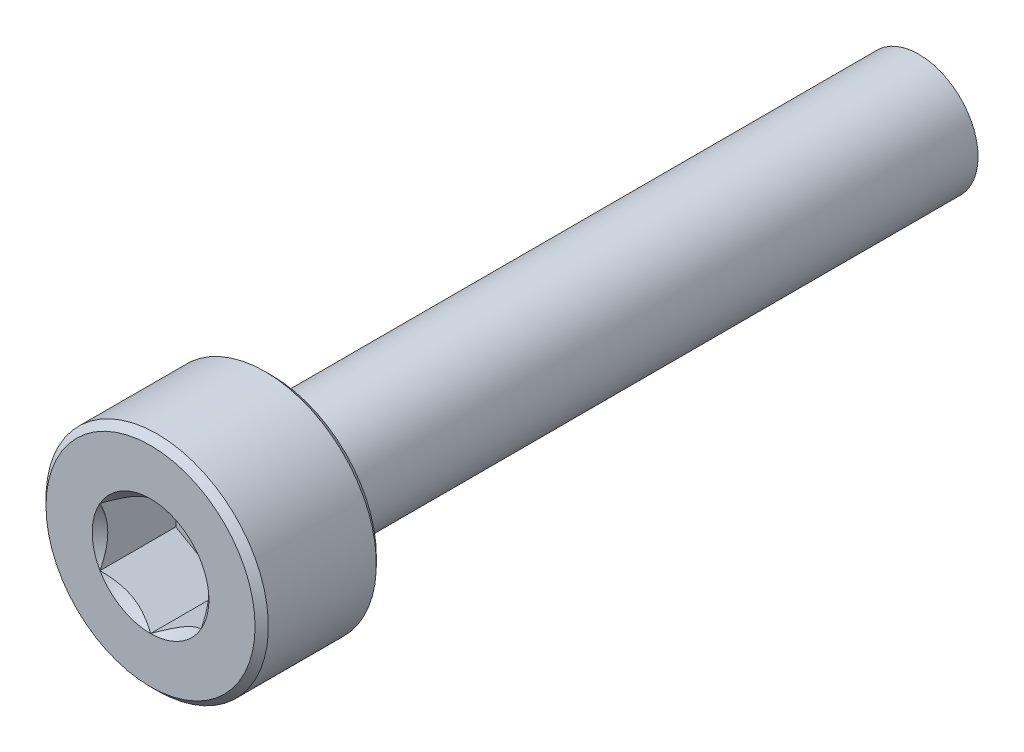
ISO-10303-21;
HEADER;
FILE_DESCRIPTION(('STEP AP214'),'2;1');
FILE_NAME('part.step','',(''),(''),'','','');
FILE_SCHEMA(('AUTOMOTIVE_DESIGN { 1 0 10303 214 1 1 1 1 }'));
ENDSEC;
DATA;
#1=APPLICATION_CONTEXT('core data for automotive mechanical design processes');
#2=APPLICATION_PROTOCOL_DEFINITION('international standard','automotive_design',2000,#1);
#3=PRODUCT_CONTEXT('',#1,'mechanical');
#4=PRODUCT('Part','Part','',(#3));
#5=PRODUCT_RELATED_PRODUCT_CATEGORY('part','',(#4));
#6=PRODUCT_DEFINITION_FORMATION('','',#4);
#7=PRODUCT_DEFINITION_CONTEXT('part definition',#1,'design');
#8=PRODUCT_DEFINITION('design','',#6,#7);
#9=PRODUCT_DEFINITION_SHAPE('','',#8);
#10=(LENGTH_UNIT() NAMED_UNIT(*) SI_UNIT(.MILLI.,.METRE.));
#11=(NAMED_UNIT(*) PLANE_ANGLE_UNIT() SI_UNIT($,.RADIAN.));
#12=(NAMED_UNIT(*) SI_UNIT($,.STERADIAN.) SOLID_ANGLE_UNIT());
#13=UNCERTAINTY_MEASURE_WITH_UNIT(LENGTH_MEASURE(1.E-05),#10,'distance_accuracy_value','');
#14=(GEOMETRIC_REPRESENTATION_CONTEXT(3) GLOBAL_UNCERTAINTY_ASSIGNED_CONTEXT((#13)) GLOBAL_UNIT_ASSIGNED_CONTEXT((#10,
#11,#12)) REPRESENTATION_CONTEXT('',''));
#15=CARTESIAN_POINT('',(0.,0.,0.));
#16=DIRECTION('',(0.,0.,1.));
#17=DIRECTION('',(1.,0.,0.));
#18=AXIS2_PLACEMENT_3D('',#15,#16,#17);
#19=CARTESIAN_POINT('',(0.,1.44337567297406,1.125));
#20=DIRECTION('',(-0.5,0.866025403784439,0.));
#21=DIRECTION('',(-0.866025403784439,-0.5,0.));
#22=AXIS2_PLACEMENT_3D('',#19,#20,#21);
#23=PLANE('',#22);
#24=CARTESIAN_POINT('',(-1.25000000002046,0.721687836475214,2.99999999993768));
#25=CARTESIAN_POINT('',(-1.20703689151522,0.746492598735941,2.97521903965439));
#26=CARTESIAN_POINT('',(-1.16335543597231,0.771712098852232,2.9518937493978));
#27=CARTESIAN_POINT('',(-1.07428446545196,0.823137247659137,2.90918613884251));
#28=CARTESIAN_POINT('',(-1.02888648444924,0.849347784211724,2.88982757328044));
#29=CARTESIAN_POINT('',(-0.937343688533541,0.902200042076024,2.85666621583229));
#30=CARTESIAN_POINT('',(-0.891222174151712,0.928828310819806,2.84278009670178));
#31=CARTESIAN_POINT('',(-0.797964038898588,0.98267092031232,2.82138590171677));
#32=CARTESIAN_POINT('',(-0.750830264939339,1.00988361739562,2.81386186183798));
#33=CARTESIAN_POINT('',(-0.66959091352587,1.05678717880297,2.80707282771215));
#34=CARTESIAN_POINT('',(-0.635590177988363,1.0764175126182,2.80606818857052));
#35=CARTESIAN_POINT('',(-0.567648554679239,1.1156436271249,2.8077634951368));
#36=CARTESIAN_POINT('',(-0.533707681785917,1.13523939922639,2.81046425917701));
#37=CARTESIAN_POINT('',(-0.466153619739256,1.17424175513388,2.81941424826014));
#38=CARTESIAN_POINT('',(-0.43254076490084,1.19364814592307,2.82566677297234));
#39=CARTESIAN_POINT('',(-0.365876260760942,1.23213691533364,2.84138353916048));
#40=CARTESIAN_POINT('',(-0.332824858671666,1.25121915122697,2.85084915877331));
#41=CARTESIAN_POINT('',(-0.248213569934498,1.30006950155586,2.87892833149611));
#42=CARTESIAN_POINT('',(-0.19718612442628,1.32953021095609,2.8996493449815));
#43=CARTESIAN_POINT('',(-0.0971276056081541,1.38729902373045,2.94632350574189));
#44=CARTESIAN_POINT('',(-0.0480906425205028,1.41561052756935,2.97225962115651));
#45=CARTESIAN_POINT('',(2.04681721194102E-11,1.44337567298588,2.99999999993768));
#46=B_SPLINE_CURVE_WITH_KNOTS('',3,(#24,#25,#26,#27,#28,#29,#30,#31,#32,#33,#34,#35,#36,#37,#38,
#39,#40,#41,#42,#43,#44,#45),.UNSPECIFIED.,.F.,.F.,(4,2,2,2,2,2,2,2,2,2,4),(0.,
0.166478683231449,0.333926926844163,0.4987166585352,0.663091654650684,0.780745575582882,
0.898425484376136,1.01621489979515,1.13405490054956,1.32111591645376,1.50757565763899),.UNSPECIFIED.);
#47=CARTESIAN_POINT('',(-1.25000000001023,0.721687836492938,2.99999999993768));
#48=VERTEX_POINT('',#47);
#49=CARTESIAN_POINT('',(7.47260085874232E-12,1.44337567298157,2.99999999993337));
#50=VERTEX_POINT('',#49);
#51=EDGE_CURVE('E21',#48,#50,#46,.T.);
#52=ORIENTED_EDGE('',*,*,#51,.F.);
#53=DIRECTION('',(0.,0.,1.));
#54=VECTOR('',#53,1.);
#55=CARTESIAN_POINT('',(-1.25,0.721687836487033,1.125));
#56=LINE('',#55,#54);
#57=CARTESIAN_POINT('',(-1.25,0.721687836487031,1.125));
#58=VERTEX_POINT('',#57);
#59=EDGE_CURVE('E104',#48,#58,#56,.F.);
#60=ORIENTED_EDGE('',*,*,#59,.T.);
#61=DIRECTION('',(-0.866025403784439,-0.5,0.));
#62=VECTOR('',#61,1.);
#63=CARTESIAN_POINT('',(0.,1.44337567297406,1.125));
#64=LINE('',#63,#62);
#65=CARTESIAN_POINT('',(0.,1.44337567297406,1.125));
#66=VERTEX_POINT('',#65);
#67=EDGE_CURVE('E77',#66,#58,#64,.T.);
#68=ORIENTED_EDGE('',*,*,#67,.F.);
#69=DIRECTION('',(0.,0.,1.));
#70=VECTOR('',#69,1.);
#71=CARTESIAN_POINT('',(0.,1.44337567297406,1.125));
#72=LINE('',#71,#70);
#73=EDGE_CURVE('E76',#66,#50,#72,.T.);
#74=ORIENTED_EDGE('',*,*,#73,.T.);
#75=EDGE_LOOP('',(#52,#60,#68,#74));
#76=FACE_BOUND('',#75,.T.);
#77=ADVANCED_FACE('F17',(#76),#23,.F.);
#78=CARTESIAN_POINT('',(1.25,0.721687836487033,1.125));
#79=DIRECTION('',(0.5,0.866025403784439,0.));
#80=DIRECTION('',(-0.866025403784439,0.5,0.));
#81=AXIS2_PLACEMENT_3D('',#78,#79,#80);
#82=PLANE('',#81);
#83=CARTESIAN_POINT('',(-2.04641558688216E-11,1.44337567298588,2.99999999993769));
#84=CARTESIAN_POINT('',(0.0429631084847821,1.41857091072515,2.97521903965439));
#85=CARTESIAN_POINT('',(0.0866445640276874,1.39335141060886,2.9518937493978));
#86=CARTESIAN_POINT('',(0.175715534548036,1.34192626180196,2.90918613884252));
#87=CARTESIAN_POINT('',(0.221113515550758,1.31571572524937,2.88982757328044));
#88=CARTESIAN_POINT('',(0.312656311466458,1.26286346738507,2.8566662158323));
#89=CARTESIAN_POINT('',(0.358777825848286,1.23623519864129,2.84278009670178));
#90=CARTESIAN_POINT('',(0.45203596110141,1.18239258914877,2.82138590171677));
#91=CARTESIAN_POINT('',(0.499169735060659,1.15517989206548,2.81386186183799));
#92=CARTESIAN_POINT('',(0.580409086474129,1.10827633065812,2.80707282771216));
#93=CARTESIAN_POINT('',(0.614409822011635,1.0886459968429,2.80606818857052));
#94=CARTESIAN_POINT('',(0.68235144532076,1.04941988233619,2.8077634951368));
#95=CARTESIAN_POINT('',(0.716292318214081,1.0298241102347,2.81046425917701));
#96=CARTESIAN_POINT('',(0.783846380260743,0.990821754327212,2.81941424826014));
#97=CARTESIAN_POINT('',(0.817459235099159,0.97141536353802,2.82566677297234));
#98=CARTESIAN_POINT('',(0.884123739239058,0.932926594127457,2.84138353916048));
#99=CARTESIAN_POINT('',(0.917175141328333,0.913844358234119,2.85084915877331));
#100=CARTESIAN_POINT('',(1.0017864300655,0.864994007905234,2.87892833149612));
#101=CARTESIAN_POINT('',(1.05281387557372,0.835533298505006,2.8996493449815));
#102=CARTESIAN_POINT('',(1.15287239439184,0.777764485730647,2.94632350574189));
#103=CARTESIAN_POINT('',(1.20190935747949,0.74945298189175,2.97225962115651));
#104=CARTESIAN_POINT('',(1.25000000002046,0.721687836475219,2.99999999993768));
#105=B_SPLINE_CURVE_WITH_KNOTS('',3,(#83,#84,#85,#86,#87,#88,#89,#90,#91,#92,#93,#94,#95,#96,
#97,#98,#99,#100,#101,#102,#103,#104),.UNSPECIFIED.,.F.,.F.,(4,2,2,2,2,2,2,2,2,2,4),(0.,
0.166478683231448,0.333926926844163,0.498716658535199,0.663091654650683,0.780745575582882,
0.898425484376135,1.01621489979515,1.13405490054956,1.32111591645376,1.50757565763898),.UNSPECIFIED.);
#106=CARTESIAN_POINT('',(1.25000000001023,0.721687836484315,2.99999999993337));
#107=VERTEX_POINT('',#106);
#108=EDGE_CURVE('E84',#50,#107,#105,.T.);
#109=ORIENTED_EDGE('',*,*,#108,.F.);
#110=ORIENTED_EDGE('',*,*,#73,.F.);
#111=DIRECTION('',(-0.86602540378444,0.499999999999997,0.));
#112=VECTOR('',#111,1.);
#113=CARTESIAN_POINT('',(1.25,0.721687836487033,1.125));
#114=LINE('',#113,#112);
#115=CARTESIAN_POINT('',(1.25,0.721687836487033,1.125));
#116=VERTEX_POINT('',#115);
#117=EDGE_CURVE('E265',#116,#66,#114,.T.);
#118=ORIENTED_EDGE('',*,*,#117,.F.);
#119=DIRECTION('',(0.,0.,-1.));
#120=VECTOR('',#119,1.);
#121=CARTESIAN_POINT('',(1.25,0.721687836487033,1.125));
#122=LINE('',#121,#120);
#123=EDGE_CURVE('E103',#116,#107,#122,.F.);
#124=ORIENTED_EDGE('',*,*,#123,.T.);
#125=EDGE_LOOP('',(#109,#110,#118,#124));
#126=FACE_BOUND('',#125,.T.);
#127=ADVANCED_FACE('F101',(#126),#82,.F.);
#128=CARTESIAN_POINT('',(-1.25,0.721687836487032,1.125));
#129=DIRECTION('',(-1.,0.,0.));
#130=DIRECTION('',(0.,0.,1.));
#131=AXIS2_PLACEMENT_3D('',#128,#129,#130);
#132=PLANE('',#131);
#133=CARTESIAN_POINT('',(-1.25,-0.721687836510661,2.99999999993768));
#134=CARTESIAN_POINT('',(-1.25,-0.672078311976685,2.97521903965536));
#135=CARTESIAN_POINT('',(-1.25,-0.621639311731505,2.95189374940026));
#136=CARTESIAN_POINT('',(-1.25,-0.518789014092512,2.90918613884934));
#137=CARTESIAN_POINT('',(-1.25,-0.466367940974753,2.88982757329015));
#138=CARTESIAN_POINT('',(-1.25,-0.36066342522165,2.85666621584946));
#139=CARTESIAN_POINT('',(-1.25,-0.307406887722171,2.84278009672348));
#140=CARTESIAN_POINT('',(-1.25,-0.199721668713924,2.8213859017491));
#141=CARTESIAN_POINT('',(-1.25,-0.145296274536027,2.81386186187642));
#142=CARTESIAN_POINT('',(-1.25,-0.0514891516951038,2.80707282776145));
#143=CARTESIAN_POINT('',(-1.25,-0.0122284840494844,2.80606818862501));
#144=CARTESIAN_POINT('',(-1.25,0.0662237449936933,2.80776349520336));
#145=CARTESIAN_POINT('',(-1.25,0.105415289211275,2.81046425925044));
#146=CARTESIAN_POINT('',(-1.25,0.183420001054798,2.81941424834854));
#147=CARTESIAN_POINT('',(-1.25,0.222232782647117,2.82566677306883));
#148=CARTESIAN_POINT('',(-1.25,0.299210321495489,2.84138353927387));
#149=CARTESIAN_POINT('',(-1.25,0.337374793295474,2.8508491588955));
#150=CARTESIAN_POINT('',(-1.25,0.435075493909223,2.87892833161913));
#151=CARTESIAN_POINT('',(-1.25,0.493996912654634,2.89964934508769));
#152=CARTESIAN_POINT('',(-1.25,0.609534538097891,2.94632350580252));
#153=CARTESIAN_POINT('',(-1.25,0.666157545725265,2.97225962118841));
#154=CARTESIAN_POINT('',(-1.25,0.721687836510662,2.99999999993768));
#155=B_SPLINE_CURVE_WITH_KNOTS('',3,(#133,#134,#135,#136,#137,#138,#139,#140,#141,#142,#143,
#144,#145,#146,#147,#148,#149,#150,#151,#152,#153,#154),.UNSPECIFIED.,.F.,.F.,(4,2,2,2,2,2,2,2,
2,2,4),(0.,0.16647868326379,0.333926926908855,0.498716658630942,0.663091654777452,
0.78074557575464,0.898425484592938,1.01621490005705,1.13405490085658,1.32111591658946,
1.50757565760279),.UNSPECIFIED.);
#156=CARTESIAN_POINT('',(-1.25000000001023,-0.721687836492939,2.99999999993768));
#157=VERTEX_POINT('',#156);
#158=EDGE_CURVE('E61',#157,#48,#155,.T.);
#159=ORIENTED_EDGE('',*,*,#158,.F.);
#160=DIRECTION('',(0.,0.,1.));
#161=VECTOR('',#160,1.);
#162=CARTESIAN_POINT('',(-1.25,-0.721687836487032,1.125));
#163=LINE('',#162,#161);
#164=CARTESIAN_POINT('',(-1.25,-0.721687836487032,1.125));
#165=VERTEX_POINT('',#164);
#166=EDGE_CURVE('E242',#157,#165,#163,.F.);
#167=ORIENTED_EDGE('',*,*,#166,.T.);
#168=DIRECTION('',(0.,-1.,0.));
#169=VECTOR('',#168,1.);
#170=CARTESIAN_POINT('',(-1.25,-2.1650635094611,1.125));
#171=LINE('',#170,#169);
#172=EDGE_CURVE('E261',#58,#165,#171,.T.);
#173=ORIENTED_EDGE('',*,*,#172,.F.);
#174=ORIENTED_EDGE('',*,*,#59,.F.);
#175=EDGE_LOOP('',(#159,#167,#173,#174));
#176=FACE_BOUND('',#175,.T.);
#177=ADVANCED_FACE('F122',(#176),#132,.F.);
#178=CARTESIAN_POINT('',(1.25,-2.1650635094611,1.125));
#179=DIRECTION('',(0.,0.,1.));
#180=DIRECTION('',(0.,-1.,0.));
#181=AXIS2_PLACEMENT_3D('',#178,#179,#180);
#182=PLANE('',#181);
#183=ORIENTED_EDGE('',*,*,#67,.T.);
#184=ORIENTED_EDGE('',*,*,#172,.T.);
#185=DIRECTION('',(0.866025403784439,-0.5,0.));
#186=VECTOR('',#185,1.);
#187=CARTESIAN_POINT('',(-1.25,-0.721687836487032,1.125));
#188=LINE('',#187,#186);
#189=CARTESIAN_POINT('',(0.,-1.44337567297406,1.125));
#190=VERTEX_POINT('',#189);
#191=EDGE_CURVE('E144',#165,#190,#188,.T.);
#192=ORIENTED_EDGE('',*,*,#191,.T.);
#193=DIRECTION('',(0.866025403784439,0.5,0.));
#194=VECTOR('',#193,1.);
#195=CARTESIAN_POINT('',(0.,-1.44337567297406,1.125));
#196=LINE('',#195,#194);
#197=CARTESIAN_POINT('',(1.25,-0.721687836487029,1.125));
#198=VERTEX_POINT('',#197);
#199=EDGE_CURVE('E239',#190,#198,#196,.T.);
#200=ORIENTED_EDGE('',*,*,#199,.T.);
#201=DIRECTION('',(0.,1.,0.));
#202=VECTOR('',#201,1.);
#203=CARTESIAN_POINT('',(1.25,-0.721687836487032,1.125));
#204=LINE('',#203,#202);
#205=EDGE_CURVE('E256',#198,#116,#204,.T.);
#206=ORIENTED_EDGE('',*,*,#205,.T.);
#207=ORIENTED_EDGE('',*,*,#117,.T.);
#208=EDGE_LOOP('',(#183,#184,#192,#200,#206,#207));
#209=FACE_BOUND('',#208,.T.);
#210=ADVANCED_FACE('F126',(#209),#182,.T.);
#211=CARTESIAN_POINT('',(1.25,-0.721687836487032,1.125));
#212=DIRECTION('',(1.,0.,0.));
#213=DIRECTION('',(0.,0.,-1.));
#214=AXIS2_PLACEMENT_3D('',#211,#212,#213);
#215=PLANE('',#214);
#216=CARTESIAN_POINT('',(1.25,0.721687836510663,2.99999999993768));
#217=CARTESIAN_POINT('',(1.25,0.672078311976689,2.97521903965536));
#218=CARTESIAN_POINT('',(1.25,0.621639311731512,2.95189374940026));
#219=CARTESIAN_POINT('',(1.25,0.518789014092524,2.90918613884935));
#220=CARTESIAN_POINT('',(1.25,0.466367940974768,2.88982757329015));
#221=CARTESIAN_POINT('',(1.25,0.360663425221665,2.85666621584947));
#222=CARTESIAN_POINT('',(1.25,0.307406887722184,2.84278009672348));
#223=CARTESIAN_POINT('',(1.25,0.199721668713931,2.8213859017491));
#224=CARTESIAN_POINT('',(1.25,0.145296274536031,2.81386186187642));
#225=CARTESIAN_POINT('',(1.25,0.0514891516951039,2.80707282776145));
#226=CARTESIAN_POINT('',(1.25,0.0122284840494836,2.80606818862501));
#227=CARTESIAN_POINT('',(1.25,-0.0662237449936962,2.80776349520336));
#228=CARTESIAN_POINT('',(1.25,-0.105415289211279,2.81046425925044));
#229=CARTESIAN_POINT('',(1.25,-0.183420001054802,2.81941424834854));
#230=CARTESIAN_POINT('',(1.25,-0.22223278264712,2.82566677306883));
#231=CARTESIAN_POINT('',(1.25,-0.29921032149549,2.84138353927387));
#232=CARTESIAN_POINT('',(1.25,-0.337374793295474,2.8508491588955));
#233=CARTESIAN_POINT('',(1.25,-0.435075493908681,2.87892833161897));
#234=CARTESIAN_POINT('',(1.25,-0.493996912653569,2.89964934508732));
#235=CARTESIAN_POINT('',(1.25,-0.609534538095823,2.94632350580163));
#236=CARTESIAN_POINT('',(1.25,-0.666157545722716,2.97225962118722));
#237=CARTESIAN_POINT('',(1.25,-0.72168783650765,2.99999999993618));
#238=B_SPLINE_CURVE_WITH_KNOTS('',3,(#216,#217,#218,#219,#220,#221,#222,#223,#224,#225,#226,
#227,#228,#229,#230,#231,#232,#233,#234,#235,#236,#237),.UNSPECIFIED.,.F.,.F.,(4,2,2,2,2,2,2,2,
2,2,4),(0.,0.166478683263782,0.333926926908838,0.498716658630934,0.663091654777453,
0.780745575754644,0.898425484592945,1.01621490005705,1.13405490085658,1.32111591658778,
1.50757565759943),.UNSPECIFIED.);
#239=CARTESIAN_POINT('',(1.25000000000893,-0.721687836492185,2.99999999993618));
#240=VERTEX_POINT('',#239);
#241=EDGE_CURVE('E40',#107,#240,#238,.T.);
#242=ORIENTED_EDGE('',*,*,#241,.F.);
#243=ORIENTED_EDGE('',*,*,#123,.F.);
#244=ORIENTED_EDGE('',*,*,#205,.F.);
#245=DIRECTION('',(0.,0.,1.));
#246=VECTOR('',#245,1.);
#247=CARTESIAN_POINT('',(1.25,-0.721687836487029,1.125));
#248=LINE('',#247,#246);
#249=EDGE_CURVE('E235',#198,#240,#248,.T.);
#250=ORIENTED_EDGE('',*,*,#249,.T.);
#251=EDGE_LOOP('',(#242,#243,#244,#250));
#252=FACE_BOUND('',#251,.T.);
#253=ADVANCED_FACE('F130',(#252),#215,.F.);
#254=CARTESIAN_POINT('',(-1.25,-0.721687836487032,1.125));
#255=DIRECTION('',(-0.5,-0.866025403784439,0.));
#256=DIRECTION('',(0.866025403784439,-0.5,0.));
#257=AXIS2_PLACEMENT_3D('',#254,#255,#256);
#258=PLANE('',#257);
#259=CARTESIAN_POINT('',(1.78557819638402E-11,-1.44337567298437,2.99999999993618));
#260=CARTESIAN_POINT('',(-0.0429631084872356,-1.41857091072374,2.97521903965305));
#261=CARTESIAN_POINT('',(-0.0866445640299819,-1.39335141060754,2.95189374939662));
#262=CARTESIAN_POINT('',(-0.175715534549997,-1.34192626180082,2.90918613884165));
#263=CARTESIAN_POINT('',(-0.221113515552544,-1.31571572524834,2.88982757327972));
#264=CARTESIAN_POINT('',(-0.312656311467885,-1.26286346738424,2.85666621583184));
#265=CARTESIAN_POINT('',(-0.35877782584953,-1.23623519864057,2.84278009670144));
#266=CARTESIAN_POINT('',(-0.452035961102275,-1.18239258914827,2.82138590171662));
#267=CARTESIAN_POINT('',(-0.499169735061329,-1.15517989206509,2.81386186183791));
#268=CARTESIAN_POINT('',(-0.580409086474592,-1.10827633065785,2.80707282771214));
#269=CARTESIAN_POINT('',(-0.61440982201209,-1.08864599684263,2.80606818857052));
#270=CARTESIAN_POINT('',(-0.682351445321196,-1.04941988233594,2.80776349513683));
#271=CARTESIAN_POINT('',(-0.716292318214508,-1.02982411023446,2.81046425917705));
#272=CARTESIAN_POINT('',(-0.78384638026115,-0.990821754326975,2.81941424826021));
#273=CARTESIAN_POINT('',(-0.817459235099557,-0.971415363537789,2.82566677297242));
#274=CARTESIAN_POINT('',(-0.884123739239436,-0.932926594127237,2.84138353916059));
#275=CARTESIAN_POINT('',(-0.917175141328702,-0.913844358233905,2.85084915877342));
#276=CARTESIAN_POINT('',(-1.0017864300658,-0.864994007905062,2.87892833149623));
#277=CARTESIAN_POINT('',(-1.05281387557395,-0.835533298504869,2.89964934498161));
#278=CARTESIAN_POINT('',(-1.15287239439196,-0.777764485730579,2.94632350574195));
#279=CARTESIAN_POINT('',(-1.20190935747955,-0.749452981891715,2.97225962115654));
#280=CARTESIAN_POINT('',(-1.25000000002046,-0.721687836475217,2.99999999993768));
#281=B_SPLINE_CURVE_WITH_KNOTS('',3,(#259,#260,#261,#262,#263,#264,#265,#266,#267,#268,#269,
#270,#271,#272,#273,#274,#275,#276,#277,#278,#279,#280),.UNSPECIFIED.,.F.,.F.,(4,2,2,2,2,2,2,2,
2,2,4),(0.,0.166478683230744,0.333926926842737,0.498716658533073,0.663091654647863,
0.780745575580031,0.898425484373255,1.01621489979224,1.13405490054662,1.32111591645061,
1.50757565763562),.UNSPECIFIED.);
#282=CARTESIAN_POINT('',(0.,-1.44337567298437,2.99999999993618));
#283=VERTEX_POINT('',#282);
#284=EDGE_CURVE('E145',#283,#157,#281,.T.);
#285=ORIENTED_EDGE('',*,*,#284,.F.);
#286=DIRECTION('',(0.,0.,1.));
#287=VECTOR('',#286,1.);
#288=CARTESIAN_POINT('',(0.,-1.44337567297406,1.125));
#289=LINE('',#288,#287);
#290=EDGE_CURVE('E170',#283,#190,#289,.F.);
#291=ORIENTED_EDGE('',*,*,#290,.T.);
#292=ORIENTED_EDGE('',*,*,#191,.F.);
#293=ORIENTED_EDGE('',*,*,#166,.F.);
#294=EDGE_LOOP('',(#285,#291,#292,#293));
#295=FACE_BOUND('',#294,.T.);
#296=ADVANCED_FACE('F135',(#295),#258,.F.);
#297=CARTESIAN_POINT('',(0.,-1.44337567297406,1.125));
#298=DIRECTION('',(0.5,-0.866025403784439,0.));
#299=DIRECTION('',(0.866025403784439,0.5,0.));
#300=AXIS2_PLACEMENT_3D('',#297,#298,#299);
#301=PLANE('',#300);
#302=CARTESIAN_POINT('',(-2.16779668089759E-11,-1.44337567297235,2.99999999994158));
#303=CARTESIAN_POINT('',(0.0429631084855907,-1.41857091071956,2.97521903965515));
#304=CARTESIAN_POINT('',(0.0866445640290015,-1.39335141060672,2.95189374939747));
#305=CARTESIAN_POINT('',(0.175715534548926,-1.34192626180282,2.90918613884178));
#306=CARTESIAN_POINT('',(0.221113515550708,-1.31571572524976,2.88982757328038));
#307=CARTESIAN_POINT('',(0.31265631146481,-1.26286346738566,2.85666621583296));
#308=CARTESIAN_POINT('',(0.358777825845975,-1.23623519864252,2.84278009670248));
#309=CARTESIAN_POINT('',(0.452035961097685,-1.18239258915102,2.82138590171745));
#310=CARTESIAN_POINT('',(0.499169735056185,-1.15517989206808,2.81386186183861));
#311=CARTESIAN_POINT('',(0.580409086468752,-1.10827633066121,2.80707282771242));
#312=CARTESIAN_POINT('',(0.614409822006097,-1.08864599684609,2.80606818857059));
#313=CARTESIAN_POINT('',(0.682351445314909,-1.04941988233957,2.80776349513645));
#314=CARTESIAN_POINT('',(0.71629231820808,-1.02982411023817,2.81046425917643));
#315=CARTESIAN_POINT('',(0.78384638025448,-0.990821754330822,2.81941424825909));
#316=CARTESIAN_POINT('',(0.817459235092784,-0.971415363541695,2.82566677297105));
#317=CARTESIAN_POINT('',(0.884123739232476,-0.932926594131252,2.84138353915871));
#318=CARTESIAN_POINT('',(0.917175141321656,-0.913844358237969,2.8508491587713));
#319=CARTESIAN_POINT('',(1.00178643005933,-0.864994007908791,2.87892833149374));
#320=CARTESIAN_POINT('',(1.05281387556814,-0.835533298508224,2.8996493449791));
#321=CARTESIAN_POINT('',(1.15287239438736,-0.777764485733229,2.94632350573959));
#322=CARTESIAN_POINT('',(1.20190935747553,-0.749452981894035,2.97225962115433));
#323=CARTESIAN_POINT('',(1.25000000001699,-0.721687836477221,2.99999999993567));
#324=B_SPLINE_CURVE_WITH_KNOTS('',3,(#302,#303,#304,#305,#306,#307,#308,#309,#310,#311,#312,
#313,#314,#315,#316,#317,#318,#319,#320,#321,#322,#323),.UNSPECIFIED.,.F.,.F.,(4,2,2,2,2,2,2,2,
2,2,4),(0.,0.166478683229306,0.333926926839593,0.498716658528064,0.663091654641108,
0.780745575572752,0.898425484365443,1.01621489978396,1.13405490053787,1.32111591644396,
1.50757565763093),.UNSPECIFIED.);
#325=EDGE_CURVE('E162',#283,#240,#324,.T.);
#326=ORIENTED_EDGE('',*,*,#325,.T.);
#327=ORIENTED_EDGE('',*,*,#249,.F.);
#328=ORIENTED_EDGE('',*,*,#199,.F.);
#329=ORIENTED_EDGE('',*,*,#290,.F.);
#330=EDGE_LOOP('',(#326,#327,#328,#329));
#331=FACE_BOUND('',#330,.T.);
#332=ADVANCED_FACE('F172',(#331),#301,.F.);
#333=CARTESIAN_POINT('',(0.,0.,2.99999999992906));
#334=DIRECTION('',(0.,0.,1.));
#335=DIRECTION('',(1.,0.,0.));
#336=AXIS2_PLACEMENT_3D('',#333,#334,#335);
#337=CONICAL_SURFACE('',#336,1.44337567297725,0.785398163397448);
#338=ORIENTED_EDGE('',*,*,#284,.T.);
#339=CARTESIAN_POINT('',(0.,0.,2.99999999992906));
#340=DIRECTION('',(0.,0.,1.));
#341=DIRECTION('',(1.,0.,0.));
#342=AXIS2_PLACEMENT_3D('',#339,#340,#341);
#343=CIRCLE('',#342,1.44337567297725);
#344=EDGE_CURVE('E169',#283,#157,#343,.F.);
#345=ORIENTED_EDGE('',*,*,#344,.F.);
#346=EDGE_LOOP('',(#338,#345));
#347=FACE_BOUND('',#346,.T.);
#348=ADVANCED_FACE('F175',(#347),#337,.F.);
#349=CARTESIAN_POINT('',(0.,0.,2.99999999992906));
#350=DIRECTION('',(0.,0.,1.));
#351=DIRECTION('',(1.,0.,0.));
#352=AXIS2_PLACEMENT_3D('',#349,#350,#351);
#353=CONICAL_SURFACE('',#352,1.44337567297725,0.785398163543548);
#354=ORIENTED_EDGE('',*,*,#158,.T.);
#355=CARTESIAN_POINT('',(0.,0.,2.99999999992906));
#356=DIRECTION('',(0.,0.,1.));
#357=DIRECTION('',(1.,0.,0.));
#358=AXIS2_PLACEMENT_3D('',#355,#356,#357);
#359=CIRCLE('',#358,1.44337567297725);
#360=EDGE_CURVE('E94',#157,#48,#359,.F.);
#361=ORIENTED_EDGE('',*,*,#360,.F.);
#362=EDGE_LOOP('',(#354,#361));
#363=FACE_BOUND('',#362,.T.);
#364=ADVANCED_FACE('F179',(#363),#353,.F.);
#365=CARTESIAN_POINT('',(0.,0.,2.99999999992906));
#366=DIRECTION('',(0.,0.,1.));
#367=DIRECTION('',(1.,0.,0.));
#368=AXIS2_PLACEMENT_3D('',#365,#366,#367);
#369=CONICAL_SURFACE('',#368,1.44337567297725,0.785398163397448);
#370=ORIENTED_EDGE('',*,*,#51,.T.);
#371=CARTESIAN_POINT('',(0.,0.,2.99999999992906));
#372=DIRECTION('',(0.,0.,1.));
#373=DIRECTION('',(1.,0.,0.));
#374=AXIS2_PLACEMENT_3D('',#371,#372,#373);
#375=CIRCLE('',#374,1.44337567297725);
#376=EDGE_CURVE('E72',#48,#50,#375,.F.);
#377=ORIENTED_EDGE('',*,*,#376,.F.);
#378=EDGE_LOOP('',(#370,#377));
#379=FACE_BOUND('',#378,.T.);
#380=ADVANCED_FACE('F70',(#379),#369,.F.);
#381=CARTESIAN_POINT('',(0.,0.,2.99999999992906));
#382=DIRECTION('',(0.,0.,1.));
#383=DIRECTION('',(1.,0.,0.));
#384=AXIS2_PLACEMENT_3D('',#381,#382,#383);
#385=CONICAL_SURFACE('',#384,1.44337567297725,0.785398163397448);
#386=ORIENTED_EDGE('',*,*,#108,.T.);
#387=CARTESIAN_POINT('',(0.,0.,2.99999999992906));
#388=DIRECTION('',(0.,0.,1.));
#389=DIRECTION('',(1.,0.,0.));
#390=AXIS2_PLACEMENT_3D('',#387,#388,#389);
#391=CIRCLE('',#390,1.44337567297725);
#392=EDGE_CURVE('E92',#50,#107,#391,.F.);
#393=ORIENTED_EDGE('',*,*,#392,.F.);
#394=EDGE_LOOP('',(#386,#393));
#395=FACE_BOUND('',#394,.T.);
#396=ADVANCED_FACE('F97',(#395),#385,.F.);
#397=CARTESIAN_POINT('',(0.,0.,2.99999999992906));
#398=DIRECTION('',(0.,0.,1.));
#399=DIRECTION('',(0.,-1.,0.));
#400=AXIS2_PLACEMENT_3D('',#397,#398,#399);
#401=CONICAL_SURFACE('',#400,1.44337567297725,0.785398163543548);
#402=ORIENTED_EDGE('',*,*,#241,.T.);
#403=CARTESIAN_POINT('',(0.,0.,2.99999999992906));
#404=DIRECTION('',(0.,0.,1.));
#405=DIRECTION('',(0.,-1.,0.));
#406=AXIS2_PLACEMENT_3D('',#403,#404,#405);
#407=CIRCLE('',#406,1.44337567297725);
#408=EDGE_CURVE('E99',#107,#240,#407,.F.);
#409=ORIENTED_EDGE('',*,*,#408,.F.);
#410=EDGE_LOOP('',(#402,#409));
#411=FACE_BOUND('',#410,.T.);
#412=ADVANCED_FACE('F152',(#411),#401,.F.);
#413=CARTESIAN_POINT('',(0.,0.,2.99999999992906));
#414=DIRECTION('',(0.,0.,1.));
#415=DIRECTION('',(1.,0.,0.));
#416=AXIS2_PLACEMENT_3D('',#413,#414,#415);
#417=CONICAL_SURFACE('',#416,1.44337567297725,0.785398163397448);
#418=ORIENTED_EDGE('',*,*,#325,.F.);
#419=CARTESIAN_POINT('',(0.,0.,2.99999999992906));
#420=DIRECTION('',(0.,0.,1.));
#421=DIRECTION('',(1.,0.,0.));
#422=AXIS2_PLACEMENT_3D('',#419,#420,#421);
#423=CIRCLE('',#422,1.44337567297725);
#424=EDGE_CURVE('E230',#240,#283,#423,.F.);
#425=ORIENTED_EDGE('',*,*,#424,.F.);
#426=EDGE_LOOP('',(#418,#425));
#427=FACE_BOUND('',#426,.T.);
#428=ADVANCED_FACE('F156',(#427),#417,.F.);
#429=CARTESIAN_POINT('',(0.,0.,3.));
#430=DIRECTION('',(0.,0.,1.));
#431=DIRECTION('',(0.,-1.,0.));
#432=AXIS2_PLACEMENT_3D('',#429,#430,#431);
#433=PLANE('',#432);
#434=ORIENTED_EDGE('',*,*,#408,.T.);
#435=ORIENTED_EDGE('',*,*,#424,.T.);
#436=ORIENTED_EDGE('',*,*,#344,.T.);
#437=ORIENTED_EDGE('',*,*,#360,.T.);
#438=ORIENTED_EDGE('',*,*,#376,.T.);
#439=ORIENTED_EDGE('',*,*,#392,.T.);
#440=EDGE_LOOP('',(#434,#435,#436,#437,#438,#439));
#441=FACE_BOUND('',#440,.T.);
#442=CARTESIAN_POINT('',(0.,0.,3.00000000004275));
#443=DIRECTION('',(0.,0.,-1.));
#444=DIRECTION('',(0.,1.,0.));
#445=AXIS2_PLACEMENT_3D('',#442,#443,#444);
#446=CIRCLE('',#445,2.5850000000105);
#447=CARTESIAN_POINT('',(0.,2.5850000000105,3.00000000004275));
#448=VERTEX_POINT('',#447);
#449=EDGE_CURVE('E221',#448,#448,#446,.T.);
#450=ORIENTED_EDGE('',*,*,#449,.F.);
#451=EDGE_LOOP('',(#450));
#452=FACE_BOUND('',#451,.T.);
#453=ADVANCED_FACE('F90',(#441,#452),#433,.T.);
#454=CARTESIAN_POINT('',(0.,0.,2.83500000000458));
#455=DIRECTION('',(0.,0.,-1.));
#456=DIRECTION('',(0.,1.,0.));
#457=AXIS2_PLACEMENT_3D('',#454,#455,#456);
#458=CONICAL_SURFACE('',#457,2.75000000004866,0.785398163397448);
#459=ORIENTED_EDGE('',*,*,#449,.T.);
#460=EDGE_LOOP('',(#459));
#461=FACE_BOUND('',#460,.T.);
#462=CARTESIAN_POINT('',(0.,0.,2.835));
#463=DIRECTION('',(0.,0.,-1.));
#464=DIRECTION('',(0.,1.,0.));
#465=AXIS2_PLACEMENT_3D('',#462,#463,#464);
#466=CIRCLE('',#465,2.75);
#467=CARTESIAN_POINT('',(0.,2.75,2.835));
#468=VERTEX_POINT('',#467);
#469=EDGE_CURVE('E224',#468,#468,#466,.T.);
#470=ORIENTED_EDGE('',*,*,#469,.F.);
#471=EDGE_LOOP('',(#470));
#472=FACE_BOUND('',#471,.T.);
#473=ADVANCED_FACE('F211',(#461,#472),#458,.T.);
#474=CARTESIAN_POINT('',(0.,0.,3.));
#475=DIRECTION('',(0.,0.,-1.));
#476=DIRECTION('',(0.,1.,0.));
#477=AXIS2_PLACEMENT_3D('',#474,#475,#476);
#478=CYLINDRICAL_SURFACE('',#477,2.75);
#479=ORIENTED_EDGE('',*,*,#469,.T.);
#480=EDGE_LOOP('',(#479));
#481=FACE_BOUND('',#480,.T.);
#482=CARTESIAN_POINT('',(0.,0.,0.165000000038162));
#483=DIRECTION('',(0.,0.,1.));
#484=DIRECTION('',(-1.,0.,0.));
#485=AXIS2_PLACEMENT_3D('',#482,#483,#484);
#486=CIRCLE('',#485,2.75000000004866);
#487=CARTESIAN_POINT('',(-2.75000000004866,0.,0.165000000038162));
#488=VERTEX_POINT('',#487);
#489=EDGE_CURVE('E225',#488,#488,#486,.F.);
#490=ORIENTED_EDGE('',*,*,#489,.F.);
#491=EDGE_LOOP('',(#490));
#492=FACE_BOUND('',#491,.T.);
#493=ADVANCED_FACE('F208',(#481,#492),#478,.T.);
#494=CARTESIAN_POINT('',(0.,0.,0.165000000038162));
#495=DIRECTION('',(0.,0.,1.));
#496=DIRECTION('',(0.,-1.,0.));
#497=AXIS2_PLACEMENT_3D('',#494,#495,#496);
#498=CONICAL_SURFACE('',#497,2.75000000004866,0.785398163569701);
#499=CARTESIAN_POINT('',(0.,0.,0.));
#500=DIRECTION('',(0.,0.,1.));
#501=DIRECTION('',(0.,-1.,0.));
#502=AXIS2_PLACEMENT_3D('',#499,#500,#501);
#503=CIRCLE('',#502,2.58499999995365);
#504=CARTESIAN_POINT('',(0.,-2.58499999995365,0.));
#505=VERTEX_POINT('',#504);
#506=EDGE_CURVE('E228',#505,#505,#503,.T.);
#507=ORIENTED_EDGE('',*,*,#506,.T.);
#508=EDGE_LOOP('',(#507));
#509=FACE_BOUND('',#508,.T.);
#510=ORIENTED_EDGE('',*,*,#489,.T.);
#511=EDGE_LOOP('',(#510));
#512=FACE_BOUND('',#511,.T.);
#513=ADVANCED_FACE('F204',(#509,#512),#498,.T.);
#514=CARTESIAN_POINT('',(0.,0.,-16.));
#515=DIRECTION('',(0.,0.,-1.));
#516=DIRECTION('',(0.,1.,0.));
#517=AXIS2_PLACEMENT_3D('',#514,#515,#516);
#518=PLANE('',#517);
#519=CARTESIAN_POINT('',(0.,0.,-16.));
#520=DIRECTION('',(0.,0.,-1.));
#521=DIRECTION('',(0.,1.,0.));
#522=AXIS2_PLACEMENT_3D('',#519,#520,#521);
#523=CIRCLE('',#522,1.4635);
#524=CARTESIAN_POINT('',(0.,1.4635,-16.));
#525=VERTEX_POINT('',#524);
#526=EDGE_CURVE('E32',#525,#525,#523,.F.);
#527=ORIENTED_EDGE('',*,*,#526,.F.);
#528=EDGE_LOOP('',(#527));
#529=FACE_BOUND('',#528,.T.);
#530=ADVANCED_FACE('F197',(#529),#518,.T.);
#531=CARTESIAN_POINT('',(0.,0.,0.));
#532=DIRECTION('',(0.,0.,1.));
#533=DIRECTION('',(0.,-1.,0.));
#534=AXIS2_PLACEMENT_3D('',#531,#532,#533);
#535=PLANE('',#534);
#536=CARTESIAN_POINT('',(0.,0.,0.));
#537=DIRECTION('',(0.,0.,-1.));
#538=DIRECTION('',(0.,1.,0.));
#539=AXIS2_PLACEMENT_3D('',#536,#537,#538);
#540=CIRCLE('',#539,1.4635);
#541=CARTESIAN_POINT('',(0.,1.4635,0.));
#542=VERTEX_POINT('',#541);
#543=EDGE_CURVE('E11',#542,#542,#540,.T.);
#544=ORIENTED_EDGE('',*,*,#543,.F.);
#545=EDGE_LOOP('',(#544));
#546=FACE_BOUND('',#545,.T.);
#547=ORIENTED_EDGE('',*,*,#506,.F.);
#548=EDGE_LOOP('',(#547));
#549=FACE_BOUND('',#548,.T.);
#550=ADVANCED_FACE('F191',(#546,#549),#535,.F.);
#551=CARTESIAN_POINT('',(0.,0.,0.));
#552=DIRECTION('',(0.,0.,-1.));
#553=DIRECTION('',(0.,1.,0.));
#554=AXIS2_PLACEMENT_3D('',#551,#552,#553);
#555=CYLINDRICAL_SURFACE('',#554,1.4635);
#556=ORIENTED_EDGE('',*,*,#543,.T.);
#557=EDGE_LOOP('',(#556));
#558=FACE_BOUND('',#557,.T.);
#559=ORIENTED_EDGE('',*,*,#526,.T.);
#560=EDGE_LOOP('',(#559));
#561=FACE_BOUND('',#560,.T.);
#562=ADVANCED_FACE('F189',(#558,#561),#555,.T.);
#563=CLOSED_SHELL('',(#77,#127,#177,#210,#253,#296,#332,#348,#364,#380,#396,#412,#428,#453,#473,
#493,#513,#530,#550,#562));
#564=MANIFOLD_SOLID_BREP('B1',#563);
#565=ADVANCED_BREP_SHAPE_REPRESENTATION('',(#18,#564),#14);
#566=SHAPE_DEFINITION_REPRESENTATION(#9,#565);
ENDSEC;
END-ISO-10303-21;
